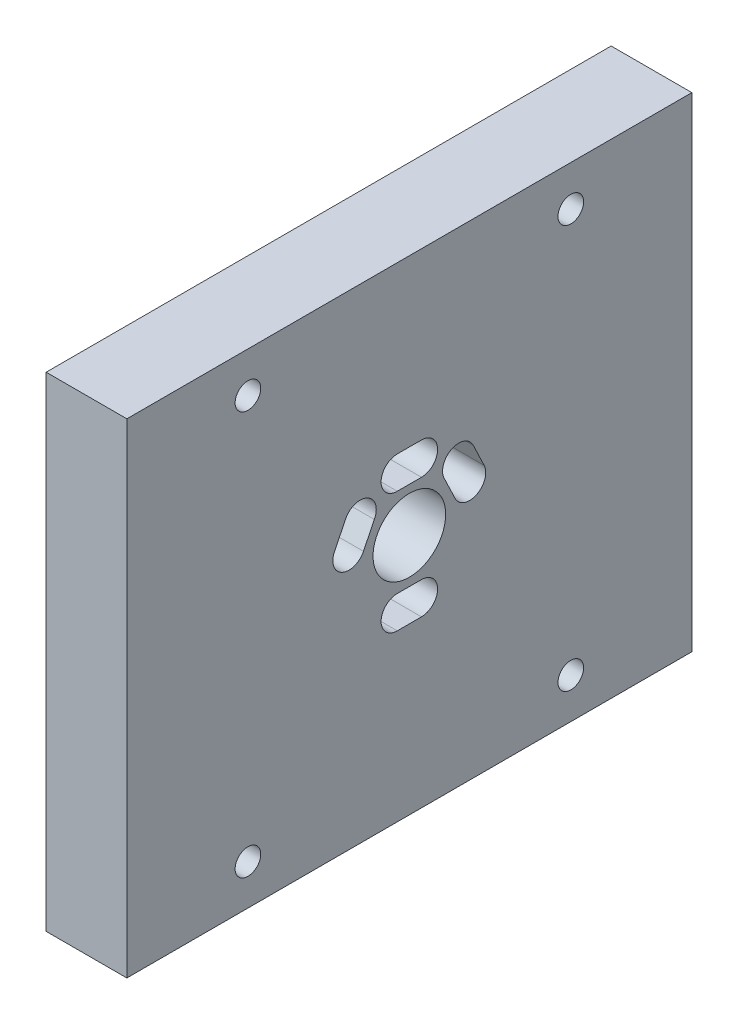
ISO-10303-21;
HEADER;
FILE_DESCRIPTION(('STEP AP214'),'2;1');
FILE_NAME('part.step','',(''),(''),'','','');
FILE_SCHEMA(('AUTOMOTIVE_DESIGN { 1 0 10303 214 1 1 1 1 }'));
ENDSEC;
DATA;
#1=APPLICATION_CONTEXT('core data for automotive mechanical design processes');
#2=APPLICATION_PROTOCOL_DEFINITION('international standard','automotive_design',2000,#1);
#3=PRODUCT_CONTEXT('',#1,'mechanical');
#4=PRODUCT('Part','Part','',(#3));
#5=PRODUCT_RELATED_PRODUCT_CATEGORY('part','',(#4));
#6=PRODUCT_DEFINITION_FORMATION('','',#4);
#7=PRODUCT_DEFINITION_CONTEXT('part definition',#1,'design');
#8=PRODUCT_DEFINITION('design','',#6,#7);
#9=PRODUCT_DEFINITION_SHAPE('','',#8);
#10=(LENGTH_UNIT() NAMED_UNIT(*) SI_UNIT(.MILLI.,.METRE.));
#11=(NAMED_UNIT(*) PLANE_ANGLE_UNIT() SI_UNIT($,.RADIAN.));
#12=(NAMED_UNIT(*) SI_UNIT($,.STERADIAN.) SOLID_ANGLE_UNIT());
#13=UNCERTAINTY_MEASURE_WITH_UNIT(LENGTH_MEASURE(1.E-05),#10,'distance_accuracy_value','');
#14=(GEOMETRIC_REPRESENTATION_CONTEXT(3) GLOBAL_UNCERTAINTY_ASSIGNED_CONTEXT((#13)) GLOBAL_UNIT_ASSIGNED_CONTEXT((#10,
#11,#12)) REPRESENTATION_CONTEXT('',''));
#15=CARTESIAN_POINT('',(0.,0.,0.));
#16=DIRECTION('',(0.,0.,1.));
#17=DIRECTION('',(1.,0.,0.));
#18=AXIS2_PLACEMENT_3D('',#15,#16,#17);
#19=CARTESIAN_POINT('',(10.,0.,0.));
#20=DIRECTION('',(1.,0.,0.));
#21=DIRECTION('',(0.,0.,-1.));
#22=AXIS2_PLACEMENT_3D('',#19,#20,#21);
#23=PLANE('',#22);
#24=DIRECTION('',(0.,0.902649656090385,0.430376112673449));
#25=VECTOR('',#24,1.);
#26=CARTESIAN_POINT('',(10.,33.5893000538088,-11.7336326254633));
#27=LINE('',#26,#25);
#28=CARTESIAN_POINT('',(10.,30.7583147353488,-13.0834237079433));
#29=VERTEX_POINT('',#28);
#30=CARTESIAN_POINT('',(10.,33.5893000538088,-11.7336326254633));
#31=VERTEX_POINT('',#30);
#32=EDGE_CURVE('E177',#29,#31,#27,.T.);
#33=ORIENTED_EDGE('',*,*,#32,.F.);
#34=CARTESIAN_POINT('',(10.,29.8982601486518,-11.277710689953));
#35=DIRECTION('',(1.,0.,0.));
#36=DIRECTION('',(0.,0.,-1.));
#37=AXIS2_PLACEMENT_3D('',#34,#35,#36);
#38=CIRCLE('',#37,2.00007334751453);
#39=CARTESIAN_POINT('',(10.,29.0382055619547,-9.47199767196282));
#40=VERTEX_POINT('',#39);
#41=EDGE_CURVE('E169',#40,#29,#38,.T.);
#42=ORIENTED_EDGE('',*,*,#41,.F.);
#43=DIRECTION('',(0.,-0.902996994662955,-0.429646863865747));
#44=VECTOR('',#43,1.);
#45=CARTESIAN_POINT('',(10.,29.0382055619547,-9.47199767196282));
#46=LINE('',#45,#44);
#47=CARTESIAN_POINT('',(10.,31.9615961769347,-8.08104552372279));
#48=VERTEX_POINT('',#47);
#49=EDGE_CURVE('E192',#48,#40,#46,.T.);
#50=ORIENTED_EDGE('',*,*,#49,.F.);
#51=CARTESIAN_POINT('',(10.,32.7289545054334,-9.92805804091433));
#52=DIRECTION('',(1.,0.,0.));
#53=DIRECTION('',(0.,0.,-1.));
#54=AXIS2_PLACEMENT_3D('',#51,#52,#53);
#55=CIRCLE('',#54,2.00007350939372);
#56=EDGE_CURVE('E190',#31,#48,#55,.T.);
#57=ORIENTED_EDGE('',*,*,#56,.F.);
#58=EDGE_LOOP('',(#33,#42,#50,#57));
#59=FACE_BOUND('',#58,.T.);
#60=DIRECTION('',(0.,0.,1.));
#61=VECTOR('',#60,1.);
#62=CARTESIAN_POINT('',(10.,22.3975308727947,-2.3131607907828));
#63=LINE('',#62,#61);
#64=CARTESIAN_POINT('',(10.,22.3975308727947,-5.31316079026278));
#65=VERTEX_POINT('',#64);
#66=CARTESIAN_POINT('',(10.,22.3975308727947,-2.3131607907828));
#67=VERTEX_POINT('',#66);
#68=EDGE_CURVE('E241',#65,#67,#63,.T.);
#69=ORIENTED_EDGE('',*,*,#68,.F.);
#70=CARTESIAN_POINT('',(10.,20.3975308735647,-5.31316079026278));
#71=DIRECTION('',(1.,0.,0.));
#72=DIRECTION('',(0.,0.,-1.));
#73=AXIS2_PLACEMENT_3D('',#70,#71,#72);
#74=CIRCLE('',#73,1.99999999922999);
#75=CARTESIAN_POINT('',(10.,18.3975308743347,-5.31316079026278));
#76=VERTEX_POINT('',#75);
#77=EDGE_CURVE('E239',#76,#65,#74,.T.);
#78=ORIENTED_EDGE('',*,*,#77,.F.);
#79=DIRECTION('',(0.,0.,-1.));
#80=VECTOR('',#79,1.);
#81=CARTESIAN_POINT('',(10.,18.3975308743347,-5.31316079026278));
#82=LINE('',#81,#80);
#83=CARTESIAN_POINT('',(10.,18.3975308743347,-2.3131607907828));
#84=VERTEX_POINT('',#83);
#85=EDGE_CURVE('E247',#84,#76,#82,.T.);
#86=ORIENTED_EDGE('',*,*,#85,.F.);
#87=CARTESIAN_POINT('',(10.,20.3975308735647,-2.3131607907828));
#88=DIRECTION('',(1.,0.,0.));
#89=DIRECTION('',(0.,0.,-1.));
#90=AXIS2_PLACEMENT_3D('',#87,#88,#89);
#91=CIRCLE('',#90,1.99999999922999);
#92=EDGE_CURVE('E244',#67,#84,#91,.T.);
#93=ORIENTED_EDGE('',*,*,#92,.F.);
#94=EDGE_LOOP('',(#69,#78,#86,#93));
#95=FACE_BOUND('',#94,.T.);
#96=CARTESIAN_POINT('',(10.,52.8975308735347,-23.8131607905228));
#97=DIRECTION('',(1.,0.,0.));
#98=DIRECTION('',(0.,0.,-1.));
#99=AXIS2_PLACEMENT_3D('',#96,#97,#98);
#100=CIRCLE('',#99,1.5875);
#101=CARTESIAN_POINT('',(10.,52.8975308735347,-25.4006607905228));
#102=VERTEX_POINT('',#101);
#103=EDGE_CURVE('E301',#102,#102,#100,.T.);
#104=ORIENTED_EDGE('',*,*,#103,.F.);
#105=EDGE_LOOP('',(#104));
#106=FACE_BOUND('',#105,.T.);
#107=CARTESIAN_POINT('',(10.,2.89753087353471,16.1868392094772));
#108=DIRECTION('',(1.,0.,0.));
#109=DIRECTION('',(0.,0.,-1.));
#110=AXIS2_PLACEMENT_3D('',#107,#108,#109);
#111=CIRCLE('',#110,1.5875);
#112=CARTESIAN_POINT('',(10.,2.89753087353471,14.5993392094772));
#113=VERTEX_POINT('',#112);
#114=EDGE_CURVE('E313',#113,#113,#111,.T.);
#115=ORIENTED_EDGE('',*,*,#114,.F.);
#116=EDGE_LOOP('',(#115));
#117=FACE_BOUND('',#116,.T.);
#118=DIRECTION('',(0.,-1.,0.));
#119=VECTOR('',#118,1.);
#120=CARTESIAN_POINT('',(10.,57.8975308735347,31.1868392094772));
#121=LINE('',#120,#119);
#122=CARTESIAN_POINT('',(10.,57.8975308735347,31.1868392094772));
#123=VERTEX_POINT('',#122);
#124=CARTESIAN_POINT('',(10.,-2.10246912646529,31.1868392094772));
#125=VERTEX_POINT('',#124);
#126=EDGE_CURVE('E325',#123,#125,#121,.T.);
#127=ORIENTED_EDGE('',*,*,#126,.T.);
#128=DIRECTION('',(0.,0.,-1.));
#129=VECTOR('',#128,1.);
#130=CARTESIAN_POINT('',(10.,-2.10246912646529,31.1868392094772));
#131=LINE('',#130,#129);
#132=CARTESIAN_POINT('',(10.,-2.10246912646529,-38.8131607905228));
#133=VERTEX_POINT('',#132);
#134=EDGE_CURVE('E328',#125,#133,#131,.T.);
#135=ORIENTED_EDGE('',*,*,#134,.T.);
#136=DIRECTION('',(0.,1.,0.));
#137=VECTOR('',#136,1.);
#138=CARTESIAN_POINT('',(10.,57.8975308735347,-38.8131607905228));
#139=LINE('',#138,#137);
#140=CARTESIAN_POINT('',(10.,57.8975308735347,-38.8131607905228));
#141=VERTEX_POINT('',#140);
#142=EDGE_CURVE('E331',#133,#141,#139,.T.);
#143=ORIENTED_EDGE('',*,*,#142,.T.);
#144=DIRECTION('',(0.,0.,1.));
#145=VECTOR('',#144,1.);
#146=CARTESIAN_POINT('',(10.,57.8975308735347,31.1868392094772));
#147=LINE('',#146,#145);
#148=EDGE_CURVE('E333',#141,#123,#147,.T.);
#149=ORIENTED_EDGE('',*,*,#148,.T.);
#150=EDGE_LOOP('',(#127,#135,#143,#149));
#151=FACE_BOUND('',#150,.T.);
#152=CARTESIAN_POINT('',(10.,52.8975308735347,16.1868392094772));
#153=DIRECTION('',(1.,0.,0.));
#154=DIRECTION('',(0.,0.,-1.));
#155=AXIS2_PLACEMENT_3D('',#152,#153,#154);
#156=CIRCLE('',#155,1.5875);
#157=CARTESIAN_POINT('',(10.,52.8975308735347,14.5993392094772));
#158=VERTEX_POINT('',#157);
#159=EDGE_CURVE('E319',#158,#158,#156,.T.);
#160=ORIENTED_EDGE('',*,*,#159,.F.);
#161=EDGE_LOOP('',(#160));
#162=FACE_BOUND('',#161,.T.);
#163=CARTESIAN_POINT('',(10.,2.89753087353471,-23.8131607905228));
#164=DIRECTION('',(1.,0.,0.));
#165=DIRECTION('',(0.,0.,-1.));
#166=AXIS2_PLACEMENT_3D('',#163,#164,#165);
#167=CIRCLE('',#166,1.5875);
#168=CARTESIAN_POINT('',(10.,2.89753087353471,-25.4006607905228));
#169=VERTEX_POINT('',#168);
#170=EDGE_CURVE('E307',#169,#169,#167,.T.);
#171=ORIENTED_EDGE('',*,*,#170,.F.);
#172=EDGE_LOOP('',(#171));
#173=FACE_BOUND('',#172,.T.);
#174=DIRECTION('',(0.,0.898794046520824,-0.438371146334613));
#175=VECTOR('',#174,1.);
#176=CARTESIAN_POINT('',(10.,31.7705559468743,0.528409533177395));
#177=LINE('',#176,#175);
#178=CARTESIAN_POINT('',(10.,29.0207563563143,1.86957640379742));
#179=VERTEX_POINT('',#178);
#180=CARTESIAN_POINT('',(10.,31.7705559468743,0.528409533177395));
#181=VERTEX_POINT('',#180);
#182=EDGE_CURVE('E272',#179,#181,#177,.T.);
#183=ORIENTED_EDGE('',*,*,#182,.F.);
#184=CARTESIAN_POINT('',(10.,29.8975308736699,3.66723056745029));
#185=DIRECTION('',(1.,0.,0.));
#186=DIRECTION('',(0.,0.,-1.));
#187=AXIS2_PLACEMENT_3D('',#184,#185,#186);
#188=CIRCLE('',#187,2.00007351024472);
#189=CARTESIAN_POINT('',(10.,30.7753413256747,5.46437910241722));
#190=VERTEX_POINT('',#189);
#191=EDGE_CURVE('E270',#190,#179,#188,.T.);
#192=ORIENTED_EDGE('',*,*,#191,.F.);
#193=DIRECTION('',(0.,-0.898541241299696,0.438889094970019));
#194=VECTOR('',#193,1.);
#195=CARTESIAN_POINT('',(10.,30.7753413256747,5.46437910241722));
#196=LINE('',#195,#194);
#197=CARTESIAN_POINT('',(10.,33.6063050236547,4.08160551541721));
#198=VERTEX_POINT('',#197);
#199=EDGE_CURVE('E278',#198,#190,#196,.T.);
#200=ORIENTED_EDGE('',*,*,#199,.F.);
#201=CARTESIAN_POINT('',(10.,32.7228387875237,2.28723056816493));
#202=DIRECTION('',(1.,0.,0.));
#203=DIRECTION('',(0.,0.,-1.));
#204=AXIS2_PLACEMENT_3D('',#201,#202,#203);
#205=CIRCLE('',#204,2.0000735090766);
#206=EDGE_CURVE('E275',#181,#198,#205,.T.);
#207=ORIENTED_EDGE('',*,*,#206,.F.);
#208=EDGE_LOOP('',(#183,#192,#200,#207));
#209=FACE_BOUND('',#208,.T.);
#210=DIRECTION('',(0.,0.,1.));
#211=VECTOR('',#210,1.);
#212=CARTESIAN_POINT('',(10.,37.3742487653747,-2.3131607907828));
#213=LINE('',#212,#211);
#214=CARTESIAN_POINT('',(10.,37.3742487653747,-5.31316079026278));
#215=VERTEX_POINT('',#214);
#216=CARTESIAN_POINT('',(10.,37.3742487653747,-2.3131607907828));
#217=VERTEX_POINT('',#216);
#218=EDGE_CURVE('E210',#215,#217,#213,.T.);
#219=ORIENTED_EDGE('',*,*,#218,.F.);
#220=CARTESIAN_POINT('',(10.,35.3742487648747,-5.31316079026278));
#221=DIRECTION('',(1.,0.,0.));
#222=DIRECTION('',(0.,0.,-1.));
#223=AXIS2_PLACEMENT_3D('',#220,#221,#222);
#224=CIRCLE('',#223,2.0000000005);
#225=CARTESIAN_POINT('',(10.,33.3742487643747,-5.31316079026278));
#226=VERTEX_POINT('',#225);
#227=EDGE_CURVE('E208',#226,#215,#224,.T.);
#228=ORIENTED_EDGE('',*,*,#227,.F.);
#229=DIRECTION('',(0.,0.,-1.));
#230=VECTOR('',#229,1.);
#231=CARTESIAN_POINT('',(10.,33.3742487643747,-5.31316079026278));
#232=LINE('',#231,#230);
#233=CARTESIAN_POINT('',(10.,33.3742487643747,-2.3131607907828));
#234=VERTEX_POINT('',#233);
#235=EDGE_CURVE('E216',#234,#226,#232,.T.);
#236=ORIENTED_EDGE('',*,*,#235,.F.);
#237=CARTESIAN_POINT('',(10.,35.3742487648747,-2.3131607907828));
#238=DIRECTION('',(1.,0.,0.));
#239=DIRECTION('',(0.,0.,-1.));
#240=AXIS2_PLACEMENT_3D('',#237,#238,#239);
#241=CIRCLE('',#240,2.0000000005);
#242=EDGE_CURVE('E213',#217,#234,#241,.T.);
#243=ORIENTED_EDGE('',*,*,#242,.F.);
#244=EDGE_LOOP('',(#219,#228,#236,#243));
#245=FACE_BOUND('',#244,.T.);
#246=CARTESIAN_POINT('',(10.,27.8975308735347,-3.81316079052279));
#247=DIRECTION('',(1.,0.,0.));
#248=DIRECTION('',(0.,0.,-1.));
#249=AXIS2_PLACEMENT_3D('',#246,#247,#248);
#250=CIRCLE('',#249,4.49999999921999);
#251=CARTESIAN_POINT('',(10.,27.8975308735347,-8.31316078974278));
#252=VERTEX_POINT('',#251);
#253=EDGE_CURVE('E198',#252,#252,#250,.T.);
#254=ORIENTED_EDGE('',*,*,#253,.F.);
#255=EDGE_LOOP('',(#254));
#256=FACE_BOUND('',#255,.T.);
#257=ADVANCED_FACE('F32',(#59,#95,#106,#117,#151,#162,#173,#209,#245,#256),#23,.T.);
#258=CARTESIAN_POINT('',(0.,0.,0.));
#259=DIRECTION('',(1.,0.,0.));
#260=DIRECTION('',(0.,0.,-1.));
#261=AXIS2_PLACEMENT_3D('',#258,#259,#260);
#262=PLANE('',#261);
#263=CARTESIAN_POINT('',(0.,29.8982601486518,-11.277710689953));
#264=DIRECTION('',(1.,0.,0.));
#265=DIRECTION('',(0.,0.,-1.));
#266=AXIS2_PLACEMENT_3D('',#263,#264,#265);
#267=CIRCLE('',#266,2.00007334751453);
#268=CARTESIAN_POINT('',(0.,29.0382055619547,-9.47199767196282));
#269=VERTEX_POINT('',#268);
#270=CARTESIAN_POINT('',(0.,30.7583147353488,-13.0834237079433));
#271=VERTEX_POINT('',#270);
#272=EDGE_CURVE('E55',#269,#271,#267,.T.);
#273=ORIENTED_EDGE('',*,*,#272,.T.);
#274=DIRECTION('',(0.,0.902649656090385,0.430376112673449));
#275=VECTOR('',#274,1.);
#276=CARTESIAN_POINT('',(0.,33.5893000538088,-11.7336326254633));
#277=LINE('',#276,#275);
#278=CARTESIAN_POINT('',(0.,33.5893000538088,-11.7336326254633));
#279=VERTEX_POINT('',#278);
#280=EDGE_CURVE('E184',#271,#279,#277,.T.);
#281=ORIENTED_EDGE('',*,*,#280,.T.);
#282=CARTESIAN_POINT('',(0.,32.7289545054334,-9.92805804091433));
#283=DIRECTION('',(1.,0.,0.));
#284=DIRECTION('',(0.,0.,-1.));
#285=AXIS2_PLACEMENT_3D('',#282,#283,#284);
#286=CIRCLE('',#285,2.00007350939372);
#287=CARTESIAN_POINT('',(0.,31.9615961769347,-8.08104552372279));
#288=VERTEX_POINT('',#287);
#289=EDGE_CURVE('E200',#279,#288,#286,.T.);
#290=ORIENTED_EDGE('',*,*,#289,.T.);
#291=DIRECTION('',(0.,-0.902996994662955,-0.429646863865747));
#292=VECTOR('',#291,1.);
#293=CARTESIAN_POINT('',(0.,29.0382055619547,-9.47199767196282));
#294=LINE('',#293,#292);
#295=EDGE_CURVE('E178',#288,#269,#294,.T.);
#296=ORIENTED_EDGE('',*,*,#295,.T.);
#297=EDGE_LOOP('',(#273,#281,#290,#296));
#298=FACE_BOUND('',#297,.T.);
#299=CARTESIAN_POINT('',(0.,20.3975308735647,-5.31316079026278));
#300=DIRECTION('',(1.,0.,0.));
#301=DIRECTION('',(0.,0.,-1.));
#302=AXIS2_PLACEMENT_3D('',#299,#300,#301);
#303=CIRCLE('',#302,1.99999999922999);
#304=CARTESIAN_POINT('',(0.,18.3975308743347,-5.31316079026278));
#305=VERTEX_POINT('',#304);
#306=CARTESIAN_POINT('',(0.,22.3975308727947,-5.31316079026278));
#307=VERTEX_POINT('',#306);
#308=EDGE_CURVE('E238',#305,#307,#303,.T.);
#309=ORIENTED_EDGE('',*,*,#308,.T.);
#310=DIRECTION('',(0.,0.,1.));
#311=VECTOR('',#310,1.);
#312=CARTESIAN_POINT('',(0.,22.3975308727947,-2.3131607907828));
#313=LINE('',#312,#311);
#314=CARTESIAN_POINT('',(0.,22.3975308727947,-2.3131607907828));
#315=VERTEX_POINT('',#314);
#316=EDGE_CURVE('E252',#307,#315,#313,.T.);
#317=ORIENTED_EDGE('',*,*,#316,.T.);
#318=CARTESIAN_POINT('',(0.,20.3975308735647,-2.3131607907828));
#319=DIRECTION('',(1.,0.,0.));
#320=DIRECTION('',(0.,0.,-1.));
#321=AXIS2_PLACEMENT_3D('',#318,#319,#320);
#322=CIRCLE('',#321,1.99999999922999);
#323=CARTESIAN_POINT('',(0.,18.3975308743347,-2.3131607907828));
#324=VERTEX_POINT('',#323);
#325=EDGE_CURVE('E255',#315,#324,#322,.T.);
#326=ORIENTED_EDGE('',*,*,#325,.T.);
#327=DIRECTION('',(0.,0.,-1.));
#328=VECTOR('',#327,1.);
#329=CARTESIAN_POINT('',(0.,18.3975308743347,-5.31316079026278));
#330=LINE('',#329,#328);
#331=EDGE_CURVE('E242',#324,#305,#330,.T.);
#332=ORIENTED_EDGE('',*,*,#331,.T.);
#333=EDGE_LOOP('',(#309,#317,#326,#332));
#334=FACE_BOUND('',#333,.T.);
#335=CARTESIAN_POINT('',(0.,52.8975308735347,-23.8131607905228));
#336=DIRECTION('',(1.,0.,0.));
#337=DIRECTION('',(0.,0.,-1.));
#338=AXIS2_PLACEMENT_3D('',#335,#336,#337);
#339=CIRCLE('',#338,1.5875);
#340=CARTESIAN_POINT('',(0.,52.8975308735347,-25.4006607905228));
#341=VERTEX_POINT('',#340);
#342=EDGE_CURVE('E300',#341,#341,#339,.T.);
#343=ORIENTED_EDGE('',*,*,#342,.T.);
#344=EDGE_LOOP('',(#343));
#345=FACE_BOUND('',#344,.T.);
#346=CARTESIAN_POINT('',(0.,2.89753087353471,16.1868392094772));
#347=DIRECTION('',(1.,0.,0.));
#348=DIRECTION('',(0.,0.,-1.));
#349=AXIS2_PLACEMENT_3D('',#346,#347,#348);
#350=CIRCLE('',#349,1.5875);
#351=CARTESIAN_POINT('',(0.,2.89753087353471,14.5993392094772));
#352=VERTEX_POINT('',#351);
#353=EDGE_CURVE('E310',#352,#352,#350,.T.);
#354=ORIENTED_EDGE('',*,*,#353,.T.);
#355=EDGE_LOOP('',(#354));
#356=FACE_BOUND('',#355,.T.);
#357=DIRECTION('',(0.,-1.,0.));
#358=VECTOR('',#357,1.);
#359=CARTESIAN_POINT('',(0.,57.8975308735347,31.1868392094772));
#360=LINE('',#359,#358);
#361=CARTESIAN_POINT('',(0.,57.8975308735347,31.1868392094772));
#362=VERTEX_POINT('',#361);
#363=CARTESIAN_POINT('',(0.,-2.10246912646529,31.1868392094772));
#364=VERTEX_POINT('',#363);
#365=EDGE_CURVE('E322',#362,#364,#360,.T.);
#366=ORIENTED_EDGE('',*,*,#365,.F.);
#367=DIRECTION('',(0.,0.,1.));
#368=VECTOR('',#367,1.);
#369=CARTESIAN_POINT('',(0.,57.8975308735347,31.1868392094772));
#370=LINE('',#369,#368);
#371=CARTESIAN_POINT('',(0.,57.8975308735347,-38.8131607905228));
#372=VERTEX_POINT('',#371);
#373=EDGE_CURVE('E329',#372,#362,#370,.T.);
#374=ORIENTED_EDGE('',*,*,#373,.F.);
#375=DIRECTION('',(0.,1.,0.));
#376=VECTOR('',#375,1.);
#377=CARTESIAN_POINT('',(0.,57.8975308735347,-38.8131607905228));
#378=LINE('',#377,#376);
#379=CARTESIAN_POINT('',(0.,-2.10246912646529,-38.8131607905228));
#380=VERTEX_POINT('',#379);
#381=EDGE_CURVE('E340',#380,#372,#378,.T.);
#382=ORIENTED_EDGE('',*,*,#381,.F.);
#383=DIRECTION('',(0.,0.,-1.));
#384=VECTOR('',#383,1.);
#385=CARTESIAN_POINT('',(0.,-2.10246912646529,31.1868392094772));
#386=LINE('',#385,#384);
#387=EDGE_CURVE('E338',#364,#380,#386,.T.);
#388=ORIENTED_EDGE('',*,*,#387,.F.);
#389=EDGE_LOOP('',(#366,#374,#382,#388));
#390=FACE_BOUND('',#389,.T.);
#391=CARTESIAN_POINT('',(0.,52.8975308735347,16.1868392094772));
#392=DIRECTION('',(1.,0.,0.));
#393=DIRECTION('',(0.,0.,-1.));
#394=AXIS2_PLACEMENT_3D('',#391,#392,#393);
#395=CIRCLE('',#394,1.5875);
#396=CARTESIAN_POINT('',(0.,52.8975308735347,14.5993392094772));
#397=VERTEX_POINT('',#396);
#398=EDGE_CURVE('E316',#397,#397,#395,.T.);
#399=ORIENTED_EDGE('',*,*,#398,.T.);
#400=EDGE_LOOP('',(#399));
#401=FACE_BOUND('',#400,.T.);
#402=CARTESIAN_POINT('',(0.,2.89753087353471,-23.8131607905228));
#403=DIRECTION('',(1.,0.,0.));
#404=DIRECTION('',(0.,0.,-1.));
#405=AXIS2_PLACEMENT_3D('',#402,#403,#404);
#406=CIRCLE('',#405,1.5875);
#407=CARTESIAN_POINT('',(0.,2.89753087353471,-25.4006607905228));
#408=VERTEX_POINT('',#407);
#409=EDGE_CURVE('E304',#408,#408,#406,.T.);
#410=ORIENTED_EDGE('',*,*,#409,.T.);
#411=EDGE_LOOP('',(#410));
#412=FACE_BOUND('',#411,.T.);
#413=CARTESIAN_POINT('',(0.,29.8975308736699,3.66723056745029));
#414=DIRECTION('',(1.,0.,0.));
#415=DIRECTION('',(0.,0.,-1.));
#416=AXIS2_PLACEMENT_3D('',#413,#414,#415);
#417=CIRCLE('',#416,2.00007351024472);
#418=CARTESIAN_POINT('',(0.,30.7753413256747,5.46437910241722));
#419=VERTEX_POINT('',#418);
#420=CARTESIAN_POINT('',(0.,29.0207563563143,1.86957640379742));
#421=VERTEX_POINT('',#420);
#422=EDGE_CURVE('E269',#419,#421,#417,.T.);
#423=ORIENTED_EDGE('',*,*,#422,.T.);
#424=DIRECTION('',(0.,0.898794046520824,-0.438371146334613));
#425=VECTOR('',#424,1.);
#426=CARTESIAN_POINT('',(0.,31.7705559468743,0.528409533177395));
#427=LINE('',#426,#425);
#428=CARTESIAN_POINT('',(0.,31.7705559468743,0.528409533177395));
#429=VERTEX_POINT('',#428);
#430=EDGE_CURVE('E283',#421,#429,#427,.T.);
#431=ORIENTED_EDGE('',*,*,#430,.T.);
#432=CARTESIAN_POINT('',(0.,32.7228387875237,2.28723056816493));
#433=DIRECTION('',(1.,0.,0.));
#434=DIRECTION('',(0.,0.,-1.));
#435=AXIS2_PLACEMENT_3D('',#432,#433,#434);
#436=CIRCLE('',#435,2.0000735090766);
#437=CARTESIAN_POINT('',(0.,33.6063050236547,4.08160551541721));
#438=VERTEX_POINT('',#437);
#439=EDGE_CURVE('E286',#429,#438,#436,.T.);
#440=ORIENTED_EDGE('',*,*,#439,.T.);
#441=DIRECTION('',(0.,-0.898541241299696,0.438889094970019));
#442=VECTOR('',#441,1.);
#443=CARTESIAN_POINT('',(0.,30.7753413256747,5.46437910241722));
#444=LINE('',#443,#442);
#445=EDGE_CURVE('E273',#438,#419,#444,.T.);
#446=ORIENTED_EDGE('',*,*,#445,.T.);
#447=EDGE_LOOP('',(#423,#431,#440,#446));
#448=FACE_BOUND('',#447,.T.);
#449=CARTESIAN_POINT('',(0.,35.3742487648747,-5.31316079026278));
#450=DIRECTION('',(1.,0.,0.));
#451=DIRECTION('',(0.,0.,-1.));
#452=AXIS2_PLACEMENT_3D('',#449,#450,#451);
#453=CIRCLE('',#452,2.0000000005);
#454=CARTESIAN_POINT('',(0.,33.3742487643747,-5.31316079026278));
#455=VERTEX_POINT('',#454);
#456=CARTESIAN_POINT('',(0.,37.3742487653747,-5.31316079026278));
#457=VERTEX_POINT('',#456);
#458=EDGE_CURVE('E185',#455,#457,#453,.T.);
#459=ORIENTED_EDGE('',*,*,#458,.T.);
#460=DIRECTION('',(0.,0.,1.));
#461=VECTOR('',#460,1.);
#462=CARTESIAN_POINT('',(0.,37.3742487653747,-2.3131607907828));
#463=LINE('',#462,#461);
#464=CARTESIAN_POINT('',(0.,37.3742487653747,-2.3131607907828));
#465=VERTEX_POINT('',#464);
#466=EDGE_CURVE('E221',#457,#465,#463,.T.);
#467=ORIENTED_EDGE('',*,*,#466,.T.);
#468=CARTESIAN_POINT('',(0.,35.3742487648747,-2.3131607907828));
#469=DIRECTION('',(1.,0.,0.));
#470=DIRECTION('',(0.,0.,-1.));
#471=AXIS2_PLACEMENT_3D('',#468,#469,#470);
#472=CIRCLE('',#471,2.0000000005);
#473=CARTESIAN_POINT('',(0.,33.3742487643747,-2.3131607907828));
#474=VERTEX_POINT('',#473);
#475=EDGE_CURVE('E224',#465,#474,#472,.T.);
#476=ORIENTED_EDGE('',*,*,#475,.T.);
#477=DIRECTION('',(0.,0.,-1.));
#478=VECTOR('',#477,1.);
#479=CARTESIAN_POINT('',(0.,33.3742487643747,-5.31316079026278));
#480=LINE('',#479,#478);
#481=EDGE_CURVE('E211',#474,#455,#480,.T.);
#482=ORIENTED_EDGE('',*,*,#481,.T.);
#483=EDGE_LOOP('',(#459,#467,#476,#482));
#484=FACE_BOUND('',#483,.T.);
#485=CARTESIAN_POINT('',(0.,27.8975308735347,-3.81316079052279));
#486=DIRECTION('',(1.,0.,0.));
#487=DIRECTION('',(0.,0.,-1.));
#488=AXIS2_PLACEMENT_3D('',#485,#486,#487);
#489=CIRCLE('',#488,4.49999999921999);
#490=CARTESIAN_POINT('',(0.,27.8975308735347,-8.31316078974278));
#491=VERTEX_POINT('',#490);
#492=EDGE_CURVE('E408',#491,#491,#489,.T.);
#493=ORIENTED_EDGE('',*,*,#492,.T.);
#494=EDGE_LOOP('',(#493));
#495=FACE_BOUND('',#494,.T.);
#496=ADVANCED_FACE('F358',(#298,#334,#345,#356,#390,#401,#412,#448,#484,#495),#262,.F.);
#497=CARTESIAN_POINT('',(10.,57.8975308735347,31.1868392094772));
#498=DIRECTION('',(0.,0.,-1.));
#499=DIRECTION('',(0.,1.,0.));
#500=AXIS2_PLACEMENT_3D('',#497,#498,#499);
#501=PLANE('',#500);
#502=ORIENTED_EDGE('',*,*,#365,.T.);
#503=DIRECTION('',(-1.,0.,0.));
#504=VECTOR('',#503,1.);
#505=CARTESIAN_POINT('',(10.,-2.10246912646529,31.1868392094772));
#506=LINE('',#505,#504);
#507=EDGE_CURVE('E11',#125,#364,#506,.T.);
#508=ORIENTED_EDGE('',*,*,#507,.F.);
#509=ORIENTED_EDGE('',*,*,#126,.F.);
#510=DIRECTION('',(-1.,0.,0.));
#511=VECTOR('',#510,1.);
#512=CARTESIAN_POINT('',(10.,57.8975308735347,31.1868392094772));
#513=LINE('',#512,#511);
#514=EDGE_CURVE('E335',#123,#362,#513,.T.);
#515=ORIENTED_EDGE('',*,*,#514,.T.);
#516=EDGE_LOOP('',(#502,#508,#509,#515));
#517=FACE_BOUND('',#516,.T.);
#518=ADVANCED_FACE('F34',(#517),#501,.F.);
#519=CARTESIAN_POINT('',(10.,-2.10246912646529,31.1868392094772));
#520=DIRECTION('',(0.,1.,0.));
#521=DIRECTION('',(0.,0.,1.));
#522=AXIS2_PLACEMENT_3D('',#519,#520,#521);
#523=PLANE('',#522);
#524=ORIENTED_EDGE('',*,*,#387,.T.);
#525=DIRECTION('',(-1.,0.,0.));
#526=VECTOR('',#525,1.);
#527=CARTESIAN_POINT('',(10.,-2.10246912646529,-38.8131607905228));
#528=LINE('',#527,#526);
#529=EDGE_CURVE('E40',#133,#380,#528,.T.);
#530=ORIENTED_EDGE('',*,*,#529,.F.);
#531=ORIENTED_EDGE('',*,*,#134,.F.);
#532=ORIENTED_EDGE('',*,*,#507,.T.);
#533=EDGE_LOOP('',(#524,#530,#531,#532));
#534=FACE_BOUND('',#533,.T.);
#535=ADVANCED_FACE('F369',(#534),#523,.F.);
#536=CARTESIAN_POINT('',(10.,57.8975308735347,-38.8131607905228));
#537=DIRECTION('',(0.,0.,1.));
#538=DIRECTION('',(0.,-1.,0.));
#539=AXIS2_PLACEMENT_3D('',#536,#537,#538);
#540=PLANE('',#539);
#541=ORIENTED_EDGE('',*,*,#381,.T.);
#542=DIRECTION('',(-1.,0.,0.));
#543=VECTOR('',#542,1.);
#544=CARTESIAN_POINT('',(10.,57.8975308735347,-38.8131607905228));
#545=LINE('',#544,#543);
#546=EDGE_CURVE('E345',#141,#372,#545,.T.);
#547=ORIENTED_EDGE('',*,*,#546,.F.);
#548=ORIENTED_EDGE('',*,*,#142,.F.);
#549=ORIENTED_EDGE('',*,*,#529,.T.);
#550=EDGE_LOOP('',(#541,#547,#548,#549));
#551=FACE_BOUND('',#550,.T.);
#552=ADVANCED_FACE('F352',(#551),#540,.F.);
#553=CARTESIAN_POINT('',(10.,57.8975308735347,31.1868392094772));
#554=DIRECTION('',(0.,-1.,0.));
#555=DIRECTION('',(0.,0.,-1.));
#556=AXIS2_PLACEMENT_3D('',#553,#554,#555);
#557=PLANE('',#556);
#558=ORIENTED_EDGE('',*,*,#373,.T.);
#559=ORIENTED_EDGE('',*,*,#514,.F.);
#560=ORIENTED_EDGE('',*,*,#148,.F.);
#561=ORIENTED_EDGE('',*,*,#546,.T.);
#562=EDGE_LOOP('',(#558,#559,#560,#561));
#563=FACE_BOUND('',#562,.T.);
#564=ADVANCED_FACE('F362',(#563),#557,.F.);
#565=CARTESIAN_POINT('',(10.,52.8975308735347,16.1868392094772));
#566=DIRECTION('',(-1.,0.,0.));
#567=DIRECTION('',(0.,0.,1.));
#568=AXIS2_PLACEMENT_3D('',#565,#566,#567);
#569=CYLINDRICAL_SURFACE('',#568,1.5875);
#570=ORIENTED_EDGE('',*,*,#159,.T.);
#571=EDGE_LOOP('',(#570));
#572=FACE_BOUND('',#571,.T.);
#573=ORIENTED_EDGE('',*,*,#398,.F.);
#574=EDGE_LOOP('',(#573));
#575=FACE_BOUND('',#574,.T.);
#576=ADVANCED_FACE('F384',(#572,#575),#569,.F.);
#577=CARTESIAN_POINT('',(10.,2.89753087353471,16.1868392094772));
#578=DIRECTION('',(-1.,0.,0.));
#579=DIRECTION('',(0.,0.,1.));
#580=AXIS2_PLACEMENT_3D('',#577,#578,#579);
#581=CYLINDRICAL_SURFACE('',#580,1.5875);
#582=ORIENTED_EDGE('',*,*,#114,.T.);
#583=EDGE_LOOP('',(#582));
#584=FACE_BOUND('',#583,.T.);
#585=ORIENTED_EDGE('',*,*,#353,.F.);
#586=EDGE_LOOP('',(#585));
#587=FACE_BOUND('',#586,.T.);
#588=ADVANCED_FACE('F391',(#584,#587),#581,.F.);
#589=CARTESIAN_POINT('',(10.,2.89753087353471,-23.8131607905228));
#590=DIRECTION('',(-1.,0.,0.));
#591=DIRECTION('',(0.,0.,1.));
#592=AXIS2_PLACEMENT_3D('',#589,#590,#591);
#593=CYLINDRICAL_SURFACE('',#592,1.5875);
#594=ORIENTED_EDGE('',*,*,#170,.T.);
#595=EDGE_LOOP('',(#594));
#596=FACE_BOUND('',#595,.T.);
#597=ORIENTED_EDGE('',*,*,#409,.F.);
#598=EDGE_LOOP('',(#597));
#599=FACE_BOUND('',#598,.T.);
#600=ADVANCED_FACE('F396',(#596,#599),#593,.F.);
#601=CARTESIAN_POINT('',(10.,52.8975308735347,-23.8131607905228));
#602=DIRECTION('',(-1.,0.,0.));
#603=DIRECTION('',(0.,0.,1.));
#604=AXIS2_PLACEMENT_3D('',#601,#602,#603);
#605=CYLINDRICAL_SURFACE('',#604,1.5875);
#606=ORIENTED_EDGE('',*,*,#103,.T.);
#607=EDGE_LOOP('',(#606));
#608=FACE_BOUND('',#607,.T.);
#609=ORIENTED_EDGE('',*,*,#342,.F.);
#610=EDGE_LOOP('',(#609));
#611=FACE_BOUND('',#610,.T.);
#612=ADVANCED_FACE('F479',(#608,#611),#605,.F.);
#613=CARTESIAN_POINT('',(10.,29.8975308736699,3.66723056745029));
#614=DIRECTION('',(-1.,0.,0.));
#615=DIRECTION('',(0.,0.,1.));
#616=AXIS2_PLACEMENT_3D('',#613,#614,#615);
#617=CYLINDRICAL_SURFACE('',#616,2.00007351024472);
#618=ORIENTED_EDGE('',*,*,#422,.F.);
#619=DIRECTION('',(-1.,0.,0.));
#620=VECTOR('',#619,1.);
#621=CARTESIAN_POINT('',(10.,30.7753413256747,5.46437910241722));
#622=LINE('',#621,#620);
#623=EDGE_CURVE('E280',#190,#419,#622,.T.);
#624=ORIENTED_EDGE('',*,*,#623,.F.);
#625=ORIENTED_EDGE('',*,*,#191,.T.);
#626=DIRECTION('',(-1.,0.,0.));
#627=VECTOR('',#626,1.);
#628=CARTESIAN_POINT('',(10.,29.0207563563143,1.86957640379742));
#629=LINE('',#628,#627);
#630=EDGE_CURVE('E297',#179,#421,#629,.T.);
#631=ORIENTED_EDGE('',*,*,#630,.T.);
#632=EDGE_LOOP('',(#618,#624,#625,#631));
#633=FACE_BOUND('',#632,.T.);
#634=ADVANCED_FACE('F475',(#633),#617,.F.);
#635=CARTESIAN_POINT('',(10.,31.7705559468743,0.528409533177395));
#636=DIRECTION('',(0.,0.438371146334613,0.898794046520824));
#637=DIRECTION('',(0.,-0.898794046520824,0.438371146334613));
#638=AXIS2_PLACEMENT_3D('',#635,#636,#637);
#639=PLANE('',#638);
#640=ORIENTED_EDGE('',*,*,#430,.F.);
#641=ORIENTED_EDGE('',*,*,#630,.F.);
#642=ORIENTED_EDGE('',*,*,#182,.T.);
#643=DIRECTION('',(-1.,0.,0.));
#644=VECTOR('',#643,1.);
#645=CARTESIAN_POINT('',(10.,31.7705559468743,0.528409533177395));
#646=LINE('',#645,#644);
#647=EDGE_CURVE('E295',#181,#429,#646,.T.);
#648=ORIENTED_EDGE('',*,*,#647,.T.);
#649=EDGE_LOOP('',(#640,#641,#642,#648));
#650=FACE_BOUND('',#649,.T.);
#651=ADVANCED_FACE('F471',(#650),#639,.T.);
#652=CARTESIAN_POINT('',(10.,32.7228387875237,2.28723056816493));
#653=DIRECTION('',(-1.,0.,0.));
#654=DIRECTION('',(0.,0.,1.));
#655=AXIS2_PLACEMENT_3D('',#652,#653,#654);
#656=CYLINDRICAL_SURFACE('',#655,2.0000735090766);
#657=ORIENTED_EDGE('',*,*,#439,.F.);
#658=ORIENTED_EDGE('',*,*,#647,.F.);
#659=ORIENTED_EDGE('',*,*,#206,.T.);
#660=DIRECTION('',(-1.,0.,0.));
#661=VECTOR('',#660,1.);
#662=CARTESIAN_POINT('',(10.,33.6063050236547,4.08160551541721));
#663=LINE('',#662,#661);
#664=EDGE_CURVE('E293',#198,#438,#663,.T.);
#665=ORIENTED_EDGE('',*,*,#664,.T.);
#666=EDGE_LOOP('',(#657,#658,#659,#665));
#667=FACE_BOUND('',#666,.T.);
#668=ADVANCED_FACE('F467',(#667),#656,.F.);
#669=CARTESIAN_POINT('',(10.,30.7753413256747,5.46437910241722));
#670=DIRECTION('',(0.,-0.438889094970019,-0.898541241299696));
#671=DIRECTION('',(0.,0.898541241299696,-0.438889094970019));
#672=AXIS2_PLACEMENT_3D('',#669,#670,#671);
#673=PLANE('',#672);
#674=ORIENTED_EDGE('',*,*,#445,.F.);
#675=ORIENTED_EDGE('',*,*,#664,.F.);
#676=ORIENTED_EDGE('',*,*,#199,.T.);
#677=ORIENTED_EDGE('',*,*,#623,.T.);
#678=EDGE_LOOP('',(#674,#675,#676,#677));
#679=FACE_BOUND('',#678,.T.);
#680=ADVANCED_FACE('F463',(#679),#673,.T.);
#681=CARTESIAN_POINT('',(10.,20.3975308735647,-5.31316079026278));
#682=DIRECTION('',(-1.,0.,0.));
#683=DIRECTION('',(0.,0.,1.));
#684=AXIS2_PLACEMENT_3D('',#681,#682,#683);
#685=CYLINDRICAL_SURFACE('',#684,1.99999999922999);
#686=ORIENTED_EDGE('',*,*,#308,.F.);
#687=DIRECTION('',(-1.,0.,0.));
#688=VECTOR('',#687,1.);
#689=CARTESIAN_POINT('',(10.,18.3975308743347,-5.31316079026278));
#690=LINE('',#689,#688);
#691=EDGE_CURVE('E249',#76,#305,#690,.T.);
#692=ORIENTED_EDGE('',*,*,#691,.F.);
#693=ORIENTED_EDGE('',*,*,#77,.T.);
#694=DIRECTION('',(-1.,0.,0.));
#695=VECTOR('',#694,1.);
#696=CARTESIAN_POINT('',(10.,22.3975308727947,-5.31316079026278));
#697=LINE('',#696,#695);
#698=EDGE_CURVE('E266',#65,#307,#697,.T.);
#699=ORIENTED_EDGE('',*,*,#698,.T.);
#700=EDGE_LOOP('',(#686,#692,#693,#699));
#701=FACE_BOUND('',#700,.T.);
#702=ADVANCED_FACE('F459',(#701),#685,.F.);
#703=CARTESIAN_POINT('',(10.,22.3975308727947,-2.3131607907828));
#704=DIRECTION('',(0.,-1.,0.));
#705=DIRECTION('',(0.,0.,-1.));
#706=AXIS2_PLACEMENT_3D('',#703,#704,#705);
#707=PLANE('',#706);
#708=ORIENTED_EDGE('',*,*,#316,.F.);
#709=ORIENTED_EDGE('',*,*,#698,.F.);
#710=ORIENTED_EDGE('',*,*,#68,.T.);
#711=DIRECTION('',(-1.,0.,0.));
#712=VECTOR('',#711,1.);
#713=CARTESIAN_POINT('',(10.,22.3975308727947,-2.3131607907828));
#714=LINE('',#713,#712);
#715=EDGE_CURVE('E264',#67,#315,#714,.T.);
#716=ORIENTED_EDGE('',*,*,#715,.T.);
#717=EDGE_LOOP('',(#708,#709,#710,#716));
#718=FACE_BOUND('',#717,.T.);
#719=ADVANCED_FACE('F455',(#718),#707,.T.);
#720=CARTESIAN_POINT('',(10.,20.3975308735647,-2.3131607907828));
#721=DIRECTION('',(-1.,0.,0.));
#722=DIRECTION('',(0.,0.,1.));
#723=AXIS2_PLACEMENT_3D('',#720,#721,#722);
#724=CYLINDRICAL_SURFACE('',#723,1.99999999922999);
#725=ORIENTED_EDGE('',*,*,#325,.F.);
#726=ORIENTED_EDGE('',*,*,#715,.F.);
#727=ORIENTED_EDGE('',*,*,#92,.T.);
#728=DIRECTION('',(-1.,0.,0.));
#729=VECTOR('',#728,1.);
#730=CARTESIAN_POINT('',(10.,18.3975308743347,-2.3131607907828));
#731=LINE('',#730,#729);
#732=EDGE_CURVE('E262',#84,#324,#731,.T.);
#733=ORIENTED_EDGE('',*,*,#732,.T.);
#734=EDGE_LOOP('',(#725,#726,#727,#733));
#735=FACE_BOUND('',#734,.T.);
#736=ADVANCED_FACE('F451',(#735),#724,.F.);
#737=CARTESIAN_POINT('',(10.,18.3975308743347,-5.31316079026278));
#738=DIRECTION('',(0.,1.,0.));
#739=DIRECTION('',(0.,0.,1.));
#740=AXIS2_PLACEMENT_3D('',#737,#738,#739);
#741=PLANE('',#740);
#742=ORIENTED_EDGE('',*,*,#331,.F.);
#743=ORIENTED_EDGE('',*,*,#732,.F.);
#744=ORIENTED_EDGE('',*,*,#85,.T.);
#745=ORIENTED_EDGE('',*,*,#691,.T.);
#746=EDGE_LOOP('',(#742,#743,#744,#745));
#747=FACE_BOUND('',#746,.T.);
#748=ADVANCED_FACE('F447',(#747),#741,.T.);
#749=CARTESIAN_POINT('',(10.,35.3742487648747,-5.31316079026278));
#750=DIRECTION('',(-1.,0.,0.));
#751=DIRECTION('',(0.,0.,1.));
#752=AXIS2_PLACEMENT_3D('',#749,#750,#751);
#753=CYLINDRICAL_SURFACE('',#752,2.0000000005);
#754=ORIENTED_EDGE('',*,*,#458,.F.);
#755=DIRECTION('',(-1.,0.,0.));
#756=VECTOR('',#755,1.);
#757=CARTESIAN_POINT('',(10.,33.3742487643747,-5.31316079026278));
#758=LINE('',#757,#756);
#759=EDGE_CURVE('E218',#226,#455,#758,.T.);
#760=ORIENTED_EDGE('',*,*,#759,.F.);
#761=ORIENTED_EDGE('',*,*,#227,.T.);
#762=DIRECTION('',(-1.,0.,0.));
#763=VECTOR('',#762,1.);
#764=CARTESIAN_POINT('',(10.,37.3742487653747,-5.31316079026278));
#765=LINE('',#764,#763);
#766=EDGE_CURVE('E235',#215,#457,#765,.T.);
#767=ORIENTED_EDGE('',*,*,#766,.T.);
#768=EDGE_LOOP('',(#754,#760,#761,#767));
#769=FACE_BOUND('',#768,.T.);
#770=ADVANCED_FACE('F443',(#769),#753,.F.);
#771=CARTESIAN_POINT('',(10.,37.3742487653747,-2.3131607907828));
#772=DIRECTION('',(0.,-1.,0.));
#773=DIRECTION('',(0.,0.,-1.));
#774=AXIS2_PLACEMENT_3D('',#771,#772,#773);
#775=PLANE('',#774);
#776=ORIENTED_EDGE('',*,*,#466,.F.);
#777=ORIENTED_EDGE('',*,*,#766,.F.);
#778=ORIENTED_EDGE('',*,*,#218,.T.);
#779=DIRECTION('',(-1.,0.,0.));
#780=VECTOR('',#779,1.);
#781=CARTESIAN_POINT('',(10.,37.3742487653747,-2.3131607907828));
#782=LINE('',#781,#780);
#783=EDGE_CURVE('E233',#217,#465,#782,.T.);
#784=ORIENTED_EDGE('',*,*,#783,.T.);
#785=EDGE_LOOP('',(#776,#777,#778,#784));
#786=FACE_BOUND('',#785,.T.);
#787=ADVANCED_FACE('F439',(#786),#775,.T.);
#788=CARTESIAN_POINT('',(10.,35.3742487648747,-2.3131607907828));
#789=DIRECTION('',(-1.,0.,0.));
#790=DIRECTION('',(0.,0.,1.));
#791=AXIS2_PLACEMENT_3D('',#788,#789,#790);
#792=CYLINDRICAL_SURFACE('',#791,2.0000000005);
#793=ORIENTED_EDGE('',*,*,#475,.F.);
#794=ORIENTED_EDGE('',*,*,#783,.F.);
#795=ORIENTED_EDGE('',*,*,#242,.T.);
#796=DIRECTION('',(-1.,0.,0.));
#797=VECTOR('',#796,1.);
#798=CARTESIAN_POINT('',(10.,33.3742487643747,-2.3131607907828));
#799=LINE('',#798,#797);
#800=EDGE_CURVE('E231',#234,#474,#799,.T.);
#801=ORIENTED_EDGE('',*,*,#800,.T.);
#802=EDGE_LOOP('',(#793,#794,#795,#801));
#803=FACE_BOUND('',#802,.T.);
#804=ADVANCED_FACE('F435',(#803),#792,.F.);
#805=CARTESIAN_POINT('',(10.,33.3742487643747,-5.31316079026278));
#806=DIRECTION('',(0.,1.,0.));
#807=DIRECTION('',(0.,0.,1.));
#808=AXIS2_PLACEMENT_3D('',#805,#806,#807);
#809=PLANE('',#808);
#810=ORIENTED_EDGE('',*,*,#481,.F.);
#811=ORIENTED_EDGE('',*,*,#800,.F.);
#812=ORIENTED_EDGE('',*,*,#235,.T.);
#813=ORIENTED_EDGE('',*,*,#759,.T.);
#814=EDGE_LOOP('',(#810,#811,#812,#813));
#815=FACE_BOUND('',#814,.T.);
#816=ADVANCED_FACE('F432',(#815),#809,.T.);
#817=CARTESIAN_POINT('',(10.,29.8982601486518,-11.277710689953));
#818=DIRECTION('',(-1.,0.,0.));
#819=DIRECTION('',(0.,0.,1.));
#820=AXIS2_PLACEMENT_3D('',#817,#818,#819);
#821=CYLINDRICAL_SURFACE('',#820,2.00007334751453);
#822=ORIENTED_EDGE('',*,*,#272,.F.);
#823=DIRECTION('',(-1.,0.,0.));
#824=VECTOR('',#823,1.);
#825=CARTESIAN_POINT('',(10.,29.0382055619547,-9.47199767196282));
#826=LINE('',#825,#824);
#827=EDGE_CURVE('E173',#40,#269,#826,.T.);
#828=ORIENTED_EDGE('',*,*,#827,.F.);
#829=ORIENTED_EDGE('',*,*,#41,.T.);
#830=DIRECTION('',(-1.,0.,0.));
#831=VECTOR('',#830,1.);
#832=CARTESIAN_POINT('',(10.,30.7583147353488,-13.0834237079433));
#833=LINE('',#832,#831);
#834=EDGE_CURVE('E172',#29,#271,#833,.T.);
#835=ORIENTED_EDGE('',*,*,#834,.T.);
#836=EDGE_LOOP('',(#822,#828,#829,#835));
#837=FACE_BOUND('',#836,.T.);
#838=ADVANCED_FACE('F171',(#837),#821,.F.);
#839=CARTESIAN_POINT('',(10.,33.5893000538088,-11.7336326254633));
#840=DIRECTION('',(0.,-0.430376112673449,0.902649656090385));
#841=DIRECTION('',(0.,-0.902649656090385,-0.430376112673449));
#842=AXIS2_PLACEMENT_3D('',#839,#840,#841);
#843=PLANE('',#842);
#844=ORIENTED_EDGE('',*,*,#280,.F.);
#845=ORIENTED_EDGE('',*,*,#834,.F.);
#846=ORIENTED_EDGE('',*,*,#32,.T.);
#847=DIRECTION('',(-1.,0.,0.));
#848=VECTOR('',#847,1.);
#849=CARTESIAN_POINT('',(10.,33.5893000538088,-11.7336326254633));
#850=LINE('',#849,#848);
#851=EDGE_CURVE('E186',#31,#279,#850,.T.);
#852=ORIENTED_EDGE('',*,*,#851,.T.);
#853=EDGE_LOOP('',(#844,#845,#846,#852));
#854=FACE_BOUND('',#853,.T.);
#855=ADVANCED_FACE('F181',(#854),#843,.T.);
#856=CARTESIAN_POINT('',(10.,32.7289545054334,-9.92805804091433));
#857=DIRECTION('',(-1.,0.,0.));
#858=DIRECTION('',(0.,0.,1.));
#859=AXIS2_PLACEMENT_3D('',#856,#857,#858);
#860=CYLINDRICAL_SURFACE('',#859,2.00007350939372);
#861=ORIENTED_EDGE('',*,*,#289,.F.);
#862=ORIENTED_EDGE('',*,*,#851,.F.);
#863=ORIENTED_EDGE('',*,*,#56,.T.);
#864=DIRECTION('',(-1.,0.,0.));
#865=VECTOR('',#864,1.);
#866=CARTESIAN_POINT('',(10.,31.9615961769347,-8.08104552372279));
#867=LINE('',#866,#865);
#868=EDGE_CURVE('E47',#48,#288,#867,.T.);
#869=ORIENTED_EDGE('',*,*,#868,.T.);
#870=EDGE_LOOP('',(#861,#862,#863,#869));
#871=FACE_BOUND('',#870,.T.);
#872=ADVANCED_FACE('F422',(#871),#860,.F.);
#873=CARTESIAN_POINT('',(10.,29.0382055619547,-9.47199767196282));
#874=DIRECTION('',(0.,0.429646863865747,-0.902996994662955));
#875=DIRECTION('',(0.,0.902996994662955,0.429646863865747));
#876=AXIS2_PLACEMENT_3D('',#873,#874,#875);
#877=PLANE('',#876);
#878=ORIENTED_EDGE('',*,*,#295,.F.);
#879=ORIENTED_EDGE('',*,*,#868,.F.);
#880=ORIENTED_EDGE('',*,*,#49,.T.);
#881=ORIENTED_EDGE('',*,*,#827,.T.);
#882=EDGE_LOOP('',(#878,#879,#880,#881));
#883=FACE_BOUND('',#882,.T.);
#884=ADVANCED_FACE('F417',(#883),#877,.T.);
#885=CARTESIAN_POINT('',(10.,27.8975308735347,-3.81316079052279));
#886=DIRECTION('',(-1.,0.,0.));
#887=DIRECTION('',(0.,0.,1.));
#888=AXIS2_PLACEMENT_3D('',#885,#886,#887);
#889=CYLINDRICAL_SURFACE('',#888,4.49999999921999);
#890=ORIENTED_EDGE('',*,*,#253,.T.);
#891=EDGE_LOOP('',(#890));
#892=FACE_BOUND('',#891,.T.);
#893=ORIENTED_EDGE('',*,*,#492,.F.);
#894=EDGE_LOOP('',(#893));
#895=FACE_BOUND('',#894,.T.);
#896=ADVANCED_FACE('F414',(#892,#895),#889,.F.);
#897=CLOSED_SHELL('',(#257,#496,#518,#535,#552,#564,#576,#588,#600,#612,#634,#651,#668,#680,
#702,#719,#736,#748,#770,#787,#804,#816,#838,#855,#872,#884,#896));
#898=MANIFOLD_SOLID_BREP('B2',#897);
#899=ADVANCED_BREP_SHAPE_REPRESENTATION('',(#18,#898),#14);
#900=SHAPE_DEFINITION_REPRESENTATION(#9,#899);
ENDSEC;
END-ISO-10303-21;
